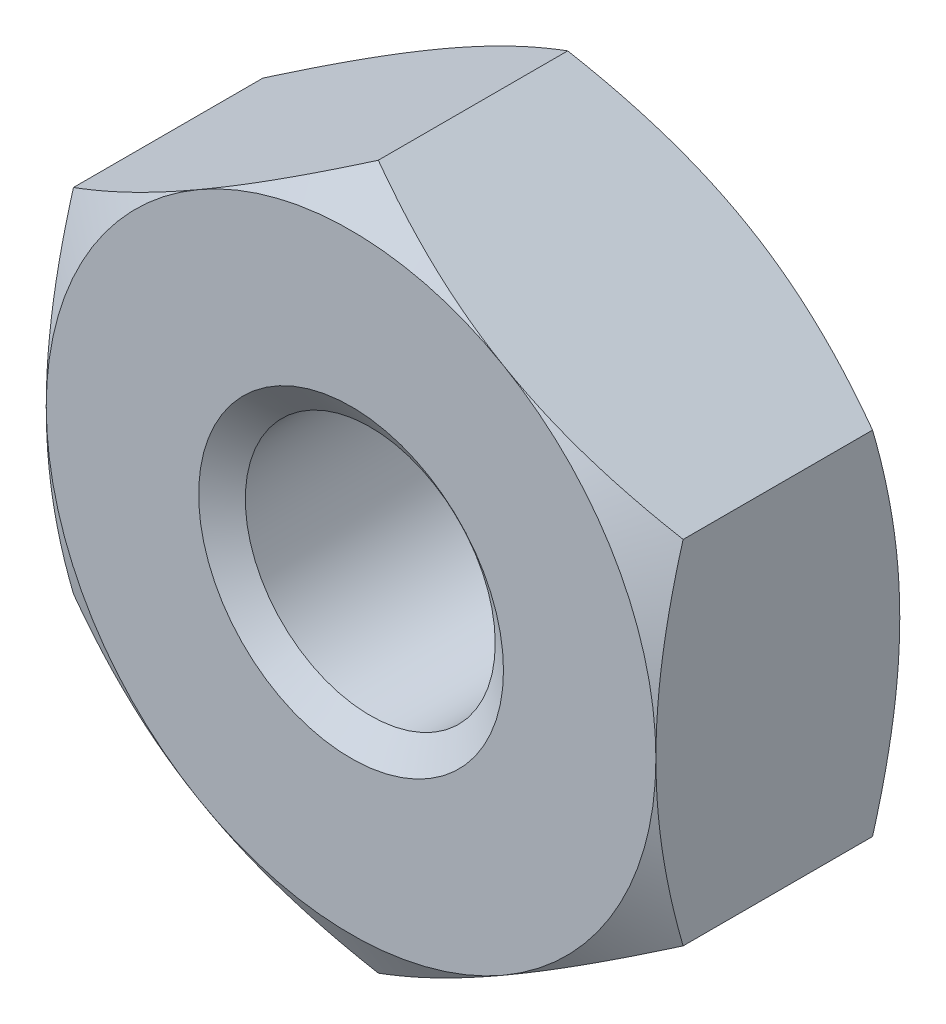
ISO-10303-21;
HEADER;
FILE_DESCRIPTION(('STEP AP214'),'2;1');
FILE_NAME('part.step','',(''),(''),'','','');
FILE_SCHEMA(('AUTOMOTIVE_DESIGN { 1 0 10303 214 1 1 1 1 }'));
ENDSEC;
DATA;
#1=APPLICATION_CONTEXT('core data for automotive mechanical design processes');
#2=APPLICATION_PROTOCOL_DEFINITION('international standard','automotive_design',2000,#1);
#3=PRODUCT_CONTEXT('',#1,'mechanical');
#4=PRODUCT('Part','Part','',(#3));
#5=PRODUCT_RELATED_PRODUCT_CATEGORY('part','',(#4));
#6=PRODUCT_DEFINITION_FORMATION('','',#4);
#7=PRODUCT_DEFINITION_CONTEXT('part definition',#1,'design');
#8=PRODUCT_DEFINITION('design','',#6,#7);
#9=PRODUCT_DEFINITION_SHAPE('','',#8);
#10=(LENGTH_UNIT() NAMED_UNIT(*) SI_UNIT(.MILLI.,.METRE.));
#11=(NAMED_UNIT(*) PLANE_ANGLE_UNIT() SI_UNIT($,.RADIAN.));
#12=(NAMED_UNIT(*) SI_UNIT($,.STERADIAN.) SOLID_ANGLE_UNIT());
#13=UNCERTAINTY_MEASURE_WITH_UNIT(LENGTH_MEASURE(1.E-05),#10,'distance_accuracy_value','');
#14=(GEOMETRIC_REPRESENTATION_CONTEXT(3) GLOBAL_UNCERTAINTY_ASSIGNED_CONTEXT((#13)) GLOBAL_UNIT_ASSIGNED_CONTEXT((#10,
#11,#12)) REPRESENTATION_CONTEXT('',''));
#15=CARTESIAN_POINT('',(0.,0.,0.));
#16=DIRECTION('',(0.,0.,1.));
#17=DIRECTION('',(1.,0.,0.));
#18=AXIS2_PLACEMENT_3D('',#15,#16,#17);
#19=CARTESIAN_POINT('',(0.,0.,-2.));
#20=DIRECTION('',(0.,0.,1.));
#21=DIRECTION('',(1.,0.,0.));
#22=AXIS2_PLACEMENT_3D('',#19,#20,#21);
#23=CYLINDRICAL_SURFACE('',#22,1.025);
#24=CARTESIAN_POINT('',(0.,0.,-0.157546696097184));
#25=DIRECTION('',(0.,0.,1.));
#26=DIRECTION('',(1.,0.,0.));
#27=AXIS2_PLACEMENT_3D('',#24,#25,#26);
#28=CIRCLE('',#27,1.025);
#29=CARTESIAN_POINT('',(1.025,0.,-0.157546696097184));
#30=VERTEX_POINT('',#29);
#31=EDGE_CURVE('E175',#30,#30,#28,.F.);
#32=ORIENTED_EDGE('',*,*,#31,.F.);
#33=EDGE_LOOP('',(#32));
#34=FACE_BOUND('',#33,.T.);
#35=CARTESIAN_POINT('',(0.,0.,-1.81705330390281));
#36=DIRECTION('',(0.,0.,-1.));
#37=DIRECTION('',(-1.,0.,0.));
#38=AXIS2_PLACEMENT_3D('',#35,#36,#37);
#39=CIRCLE('',#38,1.025);
#40=CARTESIAN_POINT('',(-1.025,0.,-1.81705330390281));
#41=VERTEX_POINT('',#40);
#42=EDGE_CURVE('E40',#41,#41,#39,.F.);
#43=ORIENTED_EDGE('',*,*,#42,.F.);
#44=EDGE_LOOP('',(#43));
#45=FACE_BOUND('',#44,.T.);
#46=ADVANCED_FACE('F35',(#34,#45),#23,.F.);
#47=CARTESIAN_POINT('',(0.,2.88675134594813,-2.));
#48=DIRECTION('',(-0.500000000000001,0.866025403784438,0.));
#49=DIRECTION('',(-0.866025403784438,-0.500000000000001,0.));
#50=AXIS2_PLACEMENT_3D('',#47,#48,#49);
#51=PLANE('',#50);
#52=DIRECTION('',(0.,0.,1.));
#53=VECTOR('',#52,1.);
#54=CARTESIAN_POINT('',(-2.5,1.44337567297406,-2.));
#55=LINE('',#54,#53);
#56=CARTESIAN_POINT('',(-2.5,1.44337567297407,-1.7767090063074));
#57=VERTEX_POINT('',#56);
#58=CARTESIAN_POINT('',(-2.5,1.44337567297406,-0.223290993692603));
#59=VERTEX_POINT('',#58);
#60=EDGE_CURVE('E165',#57,#59,#55,.T.);
#61=ORIENTED_EDGE('',*,*,#60,.T.);
#62=CARTESIAN_POINT('',(-2.5002,1.44326020292023,-0.22335766435911));
#63=CARTESIAN_POINT('',(-2.39033676526513,1.50668977106845,-0.186721620107627));
#64=CARTESIAN_POINT('',(-2.27952520010347,1.57066685804385,-0.153402218965057));
#65=CARTESIAN_POINT('',(-2.05598316653395,1.69972891130041,-0.0952422855578579));
#66=CARTESIAN_POINT('',(-1.94324872547161,1.7648161711947,-0.0704223291477383));
#67=CARTESIAN_POINT('',(-1.71917700612473,1.8941840386774,-0.0317856514410519));
#68=CARTESIAN_POINT('',(-1.60787420823262,1.95844473900197,-0.0177117961856387));
#69=CARTESIAN_POINT('',(-1.38474477253167,2.08726857876804,-0.000909152352749973));
#70=CARTESIAN_POINT('',(-1.27291894598577,2.15183124982667,0.00183354879637358));
#71=CARTESIAN_POINT('',(-1.06395802444848,2.27247489412634,-0.0038657600080535));
#72=CARTESIAN_POINT('',(-0.966791682442268,2.32857390783979,-0.0109083943818617));
#73=CARTESIAN_POINT('',(-0.773092050288997,2.44040644260542,-0.033231419124943));
#74=CARTESIAN_POINT('',(-0.676559430340267,2.4961395767184,-0.0485194384402678));
#75=CARTESIAN_POINT('',(-0.482460278259524,2.60820277442169,-0.0867390938444215));
#76=CARTESIAN_POINT('',(-0.384918318217859,2.66451865130903,-0.109832776125518));
#77=CARTESIAN_POINT('',(-0.191289391923915,2.77631036402774,-0.162246656577915));
#78=CARTESIAN_POINT('',(-0.0951999441138236,2.83178763258718,-0.19155453562455));
#79=CARTESIAN_POINT('',(0.000200000000000361,2.88686681600197,-0.223357664359111));
#80=B_SPLINE_CURVE_WITH_KNOTS('',3,(#62,#63,#64,#65,#66,#67,#68,#69,#70,#71,#72,#73,#74,#75,#76,
#77,#78,#79),.UNSPECIFIED.,.F.,.F.,(4,2,2,2,2,2,2,2,4),(0.,0.396285827362227,0.793524330152052,
1.18093086852114,1.56786160134476,1.90479741793733,2.24204551660463,2.58677531536756,
2.93082800105257),.UNSPECIFIED.);
#81=CARTESIAN_POINT('',(-1.25,2.1650635094611,0.));
#82=VERTEX_POINT('',#81);
#83=EDGE_CURVE('E134',#59,#82,#80,.T.);
#84=ORIENTED_EDGE('',*,*,#83,.T.);
#85=CARTESIAN_POINT('',(0.,2.88675134594813,-0.223290993692604));
#86=VERTEX_POINT('',#85);
#87=EDGE_CURVE('E54',#82,#86,#80,.T.);
#88=ORIENTED_EDGE('',*,*,#87,.T.);
#89=DIRECTION('',(0.,0.,1.));
#90=VECTOR('',#89,1.);
#91=CARTESIAN_POINT('',(0.,2.88675134594813,-2.));
#92=LINE('',#91,#90);
#93=CARTESIAN_POINT('',(0.,2.88675134594813,-1.7767090063074));
#94=VERTEX_POINT('',#93);
#95=EDGE_CURVE('E150',#94,#86,#92,.T.);
#96=ORIENTED_EDGE('',*,*,#95,.F.);
#97=CARTESIAN_POINT('',(-2.5002,1.44326020292023,-1.77664233564089));
#98=CARTESIAN_POINT('',(-2.39033676526513,1.50668977106845,-1.81327837989237));
#99=CARTESIAN_POINT('',(-2.27952520010347,1.57066685804385,-1.84659778103494));
#100=CARTESIAN_POINT('',(-2.05598316653395,1.69972891130041,-1.90475771444214));
#101=CARTESIAN_POINT('',(-1.94324872547161,1.7648161711947,-1.92957767085226));
#102=CARTESIAN_POINT('',(-1.71917700612473,1.8941840386774,-1.96821434855895));
#103=CARTESIAN_POINT('',(-1.60787420823262,1.95844473900197,-1.98228820381436));
#104=CARTESIAN_POINT('',(-1.38474477253167,2.08726857876804,-1.99909084764725));
#105=CARTESIAN_POINT('',(-1.27291894598577,2.15183124982667,-2.00183354879637));
#106=CARTESIAN_POINT('',(-1.06395802444848,2.27247489412634,-1.99613423999195));
#107=CARTESIAN_POINT('',(-0.966791682442269,2.32857390783979,-1.98909160561814));
#108=CARTESIAN_POINT('',(-0.773092050288997,2.44040644260542,-1.96676858087506));
#109=CARTESIAN_POINT('',(-0.676559430340268,2.4961395767184,-1.95148056155973));
#110=CARTESIAN_POINT('',(-0.482460278259524,2.60820277442169,-1.91326090615558));
#111=CARTESIAN_POINT('',(-0.384918318217859,2.66451865130903,-1.89016722387448));
#112=CARTESIAN_POINT('',(-0.191289391923915,2.77631036402774,-1.83775334342209));
#113=CARTESIAN_POINT('',(-0.0951999441138236,2.83178763258718,-1.80844546437545));
#114=CARTESIAN_POINT('',(0.00020000000000024,2.88686681600197,-1.77664233564089));
#115=B_SPLINE_CURVE_WITH_KNOTS('',3,(#97,#98,#99,#100,#101,#102,#103,#104,#105,#106,#107,#108,
#109,#110,#111,#112,#113,#114),.UNSPECIFIED.,.F.,.F.,(4,2,2,2,2,2,2,2,4),(0.,0.396285827362227,
0.793524330152052,1.18093086852114,1.56786160134475,1.90479741793733,2.24204551660463,
2.58677531536756,2.93082800105257),.UNSPECIFIED.);
#116=CARTESIAN_POINT('',(-1.25,2.1650635094611,-2.));
#117=VERTEX_POINT('',#116);
#118=EDGE_CURVE('E168',#117,#94,#115,.T.);
#119=ORIENTED_EDGE('',*,*,#118,.F.);
#120=EDGE_CURVE('E267',#57,#117,#115,.T.);
#121=ORIENTED_EDGE('',*,*,#120,.F.);
#122=EDGE_LOOP('',(#61,#84,#88,#96,#119,#121));
#123=FACE_BOUND('',#122,.T.);
#124=ADVANCED_FACE('F37',(#123),#51,.T.);
#125=CARTESIAN_POINT('',(2.5,1.44337567297406,-2.));
#126=DIRECTION('',(0.500000000000001,0.866025403784438,0.));
#127=DIRECTION('',(-0.866025403784438,0.500000000000001,0.));
#128=AXIS2_PLACEMENT_3D('',#125,#126,#127);
#129=PLANE('',#128);
#130=ORIENTED_EDGE('',*,*,#95,.T.);
#131=CARTESIAN_POINT('',(-0.000199999999999988,2.88686681600197,-0.223357664359111));
#132=CARTESIAN_POINT('',(0.109663234734871,2.82343724785375,-0.186721620107628));
#133=CARTESIAN_POINT('',(0.220474799896526,2.75946016087834,-0.153402218965058));
#134=CARTESIAN_POINT('',(0.44401683346605,2.63039810762178,-0.0952422855578587));
#135=CARTESIAN_POINT('',(0.556751274528389,2.5653108477275,-0.070422329147739));
#136=CARTESIAN_POINT('',(0.78082299387527,2.43594298024479,-0.0317856514410522));
#137=CARTESIAN_POINT('',(0.892125791767378,2.37168227992023,-0.0177117961856388));
#138=CARTESIAN_POINT('',(1.11525522746834,2.24285844015415,-0.000909152352749793));
#139=CARTESIAN_POINT('',(1.22708105401423,2.17829576909552,0.00183354879637375));
#140=CARTESIAN_POINT('',(1.43604197555152,2.05765212479586,-0.00386576000805319));
#141=CARTESIAN_POINT('',(1.53320831755773,2.0015531110824,-0.0109083943818613));
#142=CARTESIAN_POINT('',(1.726907949711,1.88972057631678,-0.0332314191249422));
#143=CARTESIAN_POINT('',(1.82344056965973,1.8339874422038,-0.0485194384402669));
#144=CARTESIAN_POINT('',(2.01753972174048,1.7219242445005,-0.0867390938444204));
#145=CARTESIAN_POINT('',(2.11508168178214,1.66560836761316,-0.109832776125517));
#146=CARTESIAN_POINT('',(2.30871060807609,1.55381665489445,-0.162246656577914));
#147=CARTESIAN_POINT('',(2.40480005588618,1.49833938633502,-0.191554535624549));
#148=CARTESIAN_POINT('',(2.5002,1.44326020292022,-0.223357664359109));
#149=B_SPLINE_CURVE_WITH_KNOTS('',3,(#131,#132,#133,#134,#135,#136,#137,#138,#139,#140,#141,
#142,#143,#144,#145,#146,#147,#148),.UNSPECIFIED.,.F.,.F.,(4,2,2,2,2,2,2,2,4),(0.,
0.396285827362228,0.793524330152053,1.18093086852114,1.56786160134476,1.90479741793733,
2.24204551660463,2.58677531536756,2.93082800105257),.UNSPECIFIED.);
#150=CARTESIAN_POINT('',(1.25,2.1650635094611,0.));
#151=VERTEX_POINT('',#150);
#152=EDGE_CURVE('E144',#86,#151,#149,.T.);
#153=ORIENTED_EDGE('',*,*,#152,.T.);
#154=CARTESIAN_POINT('',(2.5,1.44337567297407,-0.223290993692604));
#155=VERTEX_POINT('',#154);
#156=EDGE_CURVE('E61',#151,#155,#149,.T.);
#157=ORIENTED_EDGE('',*,*,#156,.T.);
#158=DIRECTION('',(0.,0.,1.));
#159=VECTOR('',#158,1.);
#160=CARTESIAN_POINT('',(2.5,1.44337567297406,-2.));
#161=LINE('',#160,#159);
#162=CARTESIAN_POINT('',(2.5,1.44337567297407,-1.7767090063074));
#163=VERTEX_POINT('',#162);
#164=EDGE_CURVE('E143',#163,#155,#161,.T.);
#165=ORIENTED_EDGE('',*,*,#164,.F.);
#166=CARTESIAN_POINT('',(-0.000199999999999988,2.88686681600197,-1.77664233564089));
#167=CARTESIAN_POINT('',(0.109663234734871,2.82343724785375,-1.81327837989237));
#168=CARTESIAN_POINT('',(0.220474799896526,2.75946016087834,-1.84659778103494));
#169=CARTESIAN_POINT('',(0.44401683346605,2.63039810762178,-1.90475771444214));
#170=CARTESIAN_POINT('',(0.556751274528389,2.5653108477275,-1.92957767085226));
#171=CARTESIAN_POINT('',(0.78082299387527,2.43594298024479,-1.96821434855895));
#172=CARTESIAN_POINT('',(0.892125791767378,2.37168227992023,-1.98228820381436));
#173=CARTESIAN_POINT('',(1.11525522746833,2.24285844015415,-1.99909084764725));
#174=CARTESIAN_POINT('',(1.22708105401423,2.17829576909552,-2.00183354879637));
#175=CARTESIAN_POINT('',(1.43604197555152,2.05765212479586,-1.99613423999195));
#176=CARTESIAN_POINT('',(1.53320831755773,2.0015531110824,-1.98909160561814));
#177=CARTESIAN_POINT('',(1.726907949711,1.88972057631678,-1.96676858087506));
#178=CARTESIAN_POINT('',(1.82344056965973,1.8339874422038,-1.95148056155973));
#179=CARTESIAN_POINT('',(2.01753972174048,1.7219242445005,-1.91326090615558));
#180=CARTESIAN_POINT('',(2.11508168178214,1.66560836761316,-1.89016722387448));
#181=CARTESIAN_POINT('',(2.30871060807609,1.55381665489446,-1.83775334342209));
#182=CARTESIAN_POINT('',(2.40480005588618,1.49833938633502,-1.80844546437545));
#183=CARTESIAN_POINT('',(2.5002,1.44326020292022,-1.77664233564089));
#184=B_SPLINE_CURVE_WITH_KNOTS('',3,(#166,#167,#168,#169,#170,#171,#172,#173,#174,#175,#176,
#177,#178,#179,#180,#181,#182,#183),.UNSPECIFIED.,.F.,.F.,(4,2,2,2,2,2,2,2,4),(0.,
0.396285827362228,0.793524330152053,1.18093086852114,1.56786160134476,1.90479741793733,
2.24204551660463,2.58677531536756,2.93082800105257),.UNSPECIFIED.);
#185=CARTESIAN_POINT('',(1.25,2.1650635094611,-2.));
#186=VERTEX_POINT('',#185);
#187=EDGE_CURVE('E260',#186,#163,#184,.T.);
#188=ORIENTED_EDGE('',*,*,#187,.F.);
#189=EDGE_CURVE('E266',#94,#186,#184,.T.);
#190=ORIENTED_EDGE('',*,*,#189,.F.);
#191=EDGE_LOOP('',(#130,#153,#157,#165,#188,#190));
#192=FACE_BOUND('',#191,.T.);
#193=ADVANCED_FACE('F141',(#192),#129,.T.);
#194=CARTESIAN_POINT('',(2.5,1.44337567297406,-2.));
#195=DIRECTION('',(-1.,0.,0.));
#196=DIRECTION('',(0.,0.,1.));
#197=AXIS2_PLACEMENT_3D('',#194,#195,#196);
#198=PLANE('',#197);
#199=CARTESIAN_POINT('',(2.5,-3.82804499372433,-1.1963167632754));
#200=CARTESIAN_POINT('',(2.5,-3.71828085649173,-1.14327266922931));
#201=CARTESIAN_POINT('',(2.5,-3.60825720059554,-1.09075587737963));
#202=CARTESIAN_POINT('',(2.5,-3.38755052986222,-0.98707821674823));
#203=CARTESIAN_POINT('',(2.5,-3.27686740487455,-0.935917582729522));
#204=CARTESIAN_POINT('',(2.5,-3.05410357303959,-0.8349840394116));
#205=CARTESIAN_POINT('',(2.5,-2.94201849305851,-0.785220746914401));
#206=CARTESIAN_POINT('',(2.5,-2.71692709217039,-0.687831615887687));
#207=CARTESIAN_POINT('',(2.5,-2.60392081964711,-0.640205665942514));
#208=CARTESIAN_POINT('',(2.5,-2.37540441715611,-0.547094156496478));
#209=CARTESIAN_POINT('',(2.5,-2.25988058014231,-0.501642052634905));
#210=CARTESIAN_POINT('',(2.5,-2.02747029246855,-0.414297644349638));
#211=CARTESIAN_POINT('',(2.5,-1.91058369184876,-0.372405735979066));
#212=CARTESIAN_POINT('',(2.5,-1.67550198908607,-0.293307342769302));
#213=CARTESIAN_POINT('',(2.5,-1.5573102732053,-0.256090896739899));
#214=CARTESIAN_POINT('',(2.5,-1.31924659147407,-0.187552097840317));
#215=CARTESIAN_POINT('',(2.5,-1.19937516991093,-0.15622788104797));
#216=CARTESIAN_POINT('',(2.5,-0.95787020436375,-0.100994246846276));
#217=CARTESIAN_POINT('',(2.5,-0.83623620019781,-0.0770868037228377));
#218=CARTESIAN_POINT('',(2.5,-0.591501703670346,-0.0382963974514645));
#219=CARTESIAN_POINT('',(2.5,-0.468401210012359,-0.0234134422823116));
#220=CARTESIAN_POINT('',(2.5,-0.222157493517464,-0.00398863321839732));
#221=CARTESIAN_POINT('',(2.5,-0.099019569433757,0.000618687975651157));
#222=CARTESIAN_POINT('',(2.5,0.147170053504668,-0.000752541484247112));
#223=CARTESIAN_POINT('',(2.5,0.270221766445128,-0.00672834425959419));
#224=CARTESIAN_POINT('',(2.5,0.480350397015948,-0.0255492091334943));
#225=CARTESIAN_POINT('',(2.5,0.567659136488637,-0.0359433100274437));
#226=CARTESIAN_POINT('',(2.5,0.741602181646858,-0.0613833814666825));
#227=CARTESIAN_POINT('',(2.5,0.828236378756332,-0.0764300856615292));
#228=CARTESIAN_POINT('',(2.5,1.08705653408106,-0.127759419343895));
#229=CARTESIAN_POINT('',(2.5,1.25802931580451,-0.170218054015721));
#230=CARTESIAN_POINT('',(2.5,1.51386408134077,-0.243447724573253));
#231=CARTESIAN_POINT('',(2.5,1.60005960225961,-0.269821213632273));
#232=CARTESIAN_POINT('',(2.5,1.77155099438377,-0.325177862642352));
#233=CARTESIAN_POINT('',(2.5,1.85684744139723,-0.354159222616821));
#234=CARTESIAN_POINT('',(2.5,2.02618400322713,-0.41412856198768));
#235=CARTESIAN_POINT('',(2.5,2.11022848716774,-0.445104328595938));
#236=CARTESIAN_POINT('',(2.5,2.27766538220571,-0.508873971119189));
#237=CARTESIAN_POINT('',(2.5,2.36105751399617,-0.541668581852106));
#238=CARTESIAN_POINT('',(2.5,2.44414811866677,-0.575193129088621));
#239=B_SPLINE_CURVE_WITH_KNOTS('',3,(#199,#200,#201,#202,#203,#204,#205,#206,#207,#208,#209,
#210,#211,#212,#213,#214,#215,#216,#217,#218,#219,#220,#221,#222,#223,#224,#225,#226,#227,#228,
#229,#230,#231,#232,#233,#234,#235,#236,#237,#238),.UNSPECIFIED.,.F.,.F.,(4,2,2,2,2,2,2,2,2,2,2,
2,2,2,2,2,2,2,2,4),(0.,0.36573237033267,0.731527644124543,1.09941621653744,1.46728558928017,
1.83967125623427,2.21209829506681,2.58371790436,2.95521975869669,3.32682041917403,
3.69842140819258,4.06764803658773,4.43677881037429,4.70042588015951,4.96411454456775,
5.49188432099894,5.76228301186056,6.03249648197686,6.30118900914356,6.56999089095293),.UNSPECIFIED.);
#240=CARTESIAN_POINT('',(2.5,-1.44337567297407,-0.223290993692604));
#241=VERTEX_POINT('',#240);
#242=CARTESIAN_POINT('',(2.5,0.,0.));
#243=VERTEX_POINT('',#242);
#244=EDGE_CURVE('E136',#241,#243,#239,.T.);
#245=ORIENTED_EDGE('',*,*,#244,.F.);
#246=DIRECTION('',(0.,0.,1.));
#247=VECTOR('',#246,1.);
#248=CARTESIAN_POINT('',(2.5,-1.44337567297407,-2.));
#249=LINE('',#248,#247);
#250=CARTESIAN_POINT('',(2.5,-1.44337567297407,-1.7767090063074));
#251=VERTEX_POINT('',#250);
#252=EDGE_CURVE('E151',#251,#241,#249,.T.);
#253=ORIENTED_EDGE('',*,*,#252,.F.);
#254=CARTESIAN_POINT('',(2.5,-3.82804499372433,-0.803683236724597));
#255=CARTESIAN_POINT('',(2.5,-3.71828085649173,-0.856727330770685));
#256=CARTESIAN_POINT('',(2.5,-3.60825720059554,-0.909244122620373));
#257=CARTESIAN_POINT('',(2.5,-3.38755052986222,-1.01292178325177));
#258=CARTESIAN_POINT('',(2.5,-3.27686740487455,-1.06408241727048));
#259=CARTESIAN_POINT('',(2.5,-3.05410357303959,-1.1650159605884));
#260=CARTESIAN_POINT('',(2.5,-2.94201849305851,-1.2147792530856));
#261=CARTESIAN_POINT('',(2.5,-2.71692709217039,-1.31216838411231));
#262=CARTESIAN_POINT('',(2.5,-2.60392081964711,-1.35979433405749));
#263=CARTESIAN_POINT('',(2.5,-2.37540441715611,-1.45290584350352));
#264=CARTESIAN_POINT('',(2.5,-2.25988058014231,-1.4983579473651));
#265=CARTESIAN_POINT('',(2.5,-2.02747029246855,-1.58570235565036));
#266=CARTESIAN_POINT('',(2.5,-1.91058369184876,-1.62759426402093));
#267=CARTESIAN_POINT('',(2.5,-1.67550198908607,-1.7066926572307));
#268=CARTESIAN_POINT('',(2.5,-1.5573102732053,-1.7439091032601));
#269=CARTESIAN_POINT('',(2.5,-1.31924659147407,-1.81244790215968));
#270=CARTESIAN_POINT('',(2.5,-1.19937516991093,-1.84377211895203));
#271=CARTESIAN_POINT('',(2.5,-0.95787020436375,-1.89900575315372));
#272=CARTESIAN_POINT('',(2.5,-0.83623620019781,-1.92291319627716));
#273=CARTESIAN_POINT('',(2.5,-0.591501703670346,-1.96170360254854));
#274=CARTESIAN_POINT('',(2.5,-0.468401210012358,-1.97658655771769));
#275=CARTESIAN_POINT('',(2.5,-0.222157493517464,-1.9960113667816));
#276=CARTESIAN_POINT('',(2.5,-0.0990195694337566,-2.00061868797565));
#277=CARTESIAN_POINT('',(2.5,0.147170053504668,-1.99924745851575));
#278=CARTESIAN_POINT('',(2.5,0.270221766445129,-1.99327165574041));
#279=CARTESIAN_POINT('',(2.5,0.480350397015948,-1.97445079086651));
#280=CARTESIAN_POINT('',(2.5,0.567659136488637,-1.96405668997256));
#281=CARTESIAN_POINT('',(2.5,0.741602181646857,-1.93861661853332));
#282=CARTESIAN_POINT('',(2.5,0.828236378756332,-1.92356991433847));
#283=CARTESIAN_POINT('',(2.5,1.08705653408106,-1.87224058065611));
#284=CARTESIAN_POINT('',(2.5,1.25802931580451,-1.82978194598428));
#285=CARTESIAN_POINT('',(2.5,1.51386408134077,-1.75655227542675));
#286=CARTESIAN_POINT('',(2.5,1.60005960225961,-1.73017878636773));
#287=CARTESIAN_POINT('',(2.5,1.77155099438377,-1.67482213735765));
#288=CARTESIAN_POINT('',(2.5,1.85684744139723,-1.64584077738318));
#289=CARTESIAN_POINT('',(2.5,2.02618400322713,-1.58587143801232));
#290=CARTESIAN_POINT('',(2.5,2.11022848716773,-1.55489567140406));
#291=CARTESIAN_POINT('',(2.5,2.27766538220571,-1.49112602888081));
#292=CARTESIAN_POINT('',(2.5,2.36105751399617,-1.45833141814789));
#293=CARTESIAN_POINT('',(2.5,2.44414811866677,-1.42480687091138));
#294=B_SPLINE_CURVE_WITH_KNOTS('',3,(#254,#255,#256,#257,#258,#259,#260,#261,#262,#263,#264,
#265,#266,#267,#268,#269,#270,#271,#272,#273,#274,#275,#276,#277,#278,#279,#280,#281,#282,#283,
#284,#285,#286,#287,#288,#289,#290,#291,#292,#293),.UNSPECIFIED.,.F.,.F.,(4,2,2,2,2,2,2,2,2,2,2,
2,2,2,2,2,2,2,2,4),(0.,0.36573237033267,0.731527644124543,1.09941621653744,1.46728558928017,
1.83967125623427,2.21209829506681,2.58371790436,2.95521975869669,3.32682041917403,
3.69842140819258,4.06764803658773,4.43677881037429,4.70042588015951,4.96411454456775,
5.49188432099893,5.76228301186056,6.03249648197686,6.30118900914356,6.56999089095293),.UNSPECIFIED.);
#295=CARTESIAN_POINT('',(2.5,0.,-2.));
#296=VERTEX_POINT('',#295);
#297=EDGE_CURVE('E274',#251,#296,#294,.T.);
#298=ORIENTED_EDGE('',*,*,#297,.T.);
#299=EDGE_CURVE('E149',#296,#163,#294,.T.);
#300=ORIENTED_EDGE('',*,*,#299,.T.);
#301=ORIENTED_EDGE('',*,*,#164,.T.);
#302=EDGE_CURVE('E126',#243,#155,#239,.T.);
#303=ORIENTED_EDGE('',*,*,#302,.F.);
#304=EDGE_LOOP('',(#245,#253,#298,#300,#301,#303));
#305=FACE_BOUND('',#304,.T.);
#306=ADVANCED_FACE('F147',(#305),#198,.F.);
#307=CARTESIAN_POINT('',(0.,-2.88675134594813,-2.));
#308=DIRECTION('',(0.500000000000001,-0.866025403784438,0.));
#309=DIRECTION('',(0.866025403784438,0.500000000000001,0.));
#310=AXIS2_PLACEMENT_3D('',#307,#308,#309);
#311=PLANE('',#310);
#312=ORIENTED_EDGE('',*,*,#252,.T.);
#313=CARTESIAN_POINT('',(2.5002,-1.44326020292023,-0.223357664359111));
#314=CARTESIAN_POINT('',(2.39033676526513,-1.50668977106845,-0.186721620107628));
#315=CARTESIAN_POINT('',(2.27952520010347,-1.57066685804386,-0.153402218965058));
#316=CARTESIAN_POINT('',(2.05598316653395,-1.69972891130042,-0.0952422855578591));
#317=CARTESIAN_POINT('',(1.94324872547161,-1.7648161711947,-0.0704223291477395));
#318=CARTESIAN_POINT('',(1.71917700612473,-1.8941840386774,-0.0317856514410532));
#319=CARTESIAN_POINT('',(1.60787420823262,-1.95844473900197,-0.0177117961856401));
#320=CARTESIAN_POINT('',(1.38474477253166,-2.08726857876805,-0.000909152352751682));
#321=CARTESIAN_POINT('',(1.27291894598577,-2.15183124982667,0.00183354879637176));
#322=CARTESIAN_POINT('',(1.06395802444848,-2.27247489412634,-0.00386576000805555));
#323=CARTESIAN_POINT('',(0.966791682442267,-2.3285739078398,-0.0109083943818639));
#324=CARTESIAN_POINT('',(0.773092050288996,-2.44040644260542,-0.0332314191249451));
#325=CARTESIAN_POINT('',(0.676559430340267,-2.4961395767184,-0.0485194384402699));
#326=CARTESIAN_POINT('',(0.482460278259523,-2.6082027744217,-0.0867390938444235));
#327=CARTESIAN_POINT('',(0.384918318217859,-2.66451865130904,-0.10983277612552));
#328=CARTESIAN_POINT('',(0.191289391923914,-2.77631036402774,-0.162246656577917));
#329=CARTESIAN_POINT('',(0.0951999441138235,-2.83178763258718,-0.191554535624552));
#330=CARTESIAN_POINT('',(-0.000200000000000339,-2.88686681600197,-0.223357664359113));
#331=B_SPLINE_CURVE_WITH_KNOTS('',3,(#313,#314,#315,#316,#317,#318,#319,#320,#321,#322,#323,
#324,#325,#326,#327,#328,#329,#330),.UNSPECIFIED.,.F.,.F.,(4,2,2,2,2,2,2,2,4),(0.,
0.396285827362228,0.793524330152053,1.18093086852114,1.56786160134476,1.90479741793733,
2.24204551660463,2.58677531536756,2.93082800105257),.UNSPECIFIED.);
#332=CARTESIAN_POINT('',(1.25,-2.1650635094611,0.));
#333=VERTEX_POINT('',#332);
#334=EDGE_CURVE('E372',#241,#333,#331,.T.);
#335=ORIENTED_EDGE('',*,*,#334,.T.);
#336=CARTESIAN_POINT('',(0.,-2.88675134594813,-0.223290993692604));
#337=VERTEX_POINT('',#336);
#338=EDGE_CURVE('E228',#333,#337,#331,.T.);
#339=ORIENTED_EDGE('',*,*,#338,.T.);
#340=DIRECTION('',(0.,0.,1.));
#341=VECTOR('',#340,1.);
#342=CARTESIAN_POINT('',(0.,-2.88675134594813,-2.));
#343=LINE('',#342,#341);
#344=CARTESIAN_POINT('',(0.,-2.88675134594813,-1.7767090063074));
#345=VERTEX_POINT('',#344);
#346=EDGE_CURVE('E156',#345,#337,#343,.T.);
#347=ORIENTED_EDGE('',*,*,#346,.F.);
#348=CARTESIAN_POINT('',(2.5002,-1.44326020292023,-1.77664233564089));
#349=CARTESIAN_POINT('',(2.39033676526513,-1.50668977106845,-1.81327837989237));
#350=CARTESIAN_POINT('',(2.27952520010347,-1.57066685804386,-1.84659778103494));
#351=CARTESIAN_POINT('',(2.05598316653395,-1.69972891130042,-1.90475771444214));
#352=CARTESIAN_POINT('',(1.94324872547161,-1.7648161711947,-1.92957767085226));
#353=CARTESIAN_POINT('',(1.71917700612473,-1.8941840386774,-1.96821434855895));
#354=CARTESIAN_POINT('',(1.60787420823262,-1.95844473900197,-1.98228820381436));
#355=CARTESIAN_POINT('',(1.38474477253166,-2.08726857876805,-1.99909084764725));
#356=CARTESIAN_POINT('',(1.27291894598577,-2.15183124982667,-2.00183354879637));
#357=CARTESIAN_POINT('',(1.06395802444848,-2.27247489412634,-1.99613423999194));
#358=CARTESIAN_POINT('',(0.966791682442267,-2.3285739078398,-1.98909160561814));
#359=CARTESIAN_POINT('',(0.773092050288996,-2.44040644260542,-1.96676858087506));
#360=CARTESIAN_POINT('',(0.676559430340266,-2.4961395767184,-1.95148056155973));
#361=CARTESIAN_POINT('',(0.482460278259523,-2.6082027744217,-1.91326090615558));
#362=CARTESIAN_POINT('',(0.384918318217859,-2.66451865130904,-1.89016722387448));
#363=CARTESIAN_POINT('',(0.191289391923914,-2.77631036402774,-1.83775334342208));
#364=CARTESIAN_POINT('',(0.0951999441138236,-2.83178763258718,-1.80844546437545));
#365=CARTESIAN_POINT('',(-0.000200000000000335,-2.88686681600197,-1.77664233564089));
#366=B_SPLINE_CURVE_WITH_KNOTS('',3,(#348,#349,#350,#351,#352,#353,#354,#355,#356,#357,#358,
#359,#360,#361,#362,#363,#364,#365),.UNSPECIFIED.,.F.,.F.,(4,2,2,2,2,2,2,2,4),(0.,
0.396285827362228,0.793524330152053,1.18093086852114,1.56786160134476,1.90479741793733,
2.24204551660463,2.58677531536756,2.93082800105257),.UNSPECIFIED.);
#367=CARTESIAN_POINT('',(1.25,-2.1650635094611,-2.));
#368=VERTEX_POINT('',#367);
#369=EDGE_CURVE('E281',#368,#345,#366,.T.);
#370=ORIENTED_EDGE('',*,*,#369,.F.);
#371=EDGE_CURVE('E280',#251,#368,#366,.T.);
#372=ORIENTED_EDGE('',*,*,#371,.F.);
#373=EDGE_LOOP('',(#312,#335,#339,#347,#370,#372));
#374=FACE_BOUND('',#373,.T.);
#375=ADVANCED_FACE('F293',(#374),#311,.T.);
#376=CARTESIAN_POINT('',(-2.5,-1.44337567297407,-2.));
#377=DIRECTION('',(-0.500000000000001,-0.866025403784438,0.));
#378=DIRECTION('',(0.866025403784438,-0.500000000000001,0.));
#379=AXIS2_PLACEMENT_3D('',#376,#377,#378);
#380=PLANE('',#379);
#381=ORIENTED_EDGE('',*,*,#346,.T.);
#382=CARTESIAN_POINT('',(0.000200000000000044,-2.88686681600197,-0.223357664359112));
#383=CARTESIAN_POINT('',(-0.109663234734871,-2.82343724785375,-0.18672162010763));
#384=CARTESIAN_POINT('',(-0.220474799896526,-2.75946016087835,-0.15340221896506));
#385=CARTESIAN_POINT('',(-0.44401683346605,-2.63039810762178,-0.0952422855578607));
#386=CARTESIAN_POINT('',(-0.556751274528389,-2.5653108477275,-0.0704223291477409));
#387=CARTESIAN_POINT('',(-0.78082299387527,-2.4359429802448,-0.0317856514410542));
#388=CARTESIAN_POINT('',(-0.892125791767379,-2.37168227992023,-0.0177117961856409));
#389=CARTESIAN_POINT('',(-1.11525522746834,-2.24285844015415,-0.000909152352751909));
#390=CARTESIAN_POINT('',(-1.22708105401423,-2.17829576909553,0.00183354879637182));
#391=CARTESIAN_POINT('',(-1.43604197555152,-2.05765212479586,-0.003865760008055));
#392=CARTESIAN_POINT('',(-1.53320831755773,-2.0015531110824,-0.0109083943818631));
#393=CARTESIAN_POINT('',(-1.726907949711,-1.88972057631678,-0.033231419124944));
#394=CARTESIAN_POINT('',(-1.82344056965973,-1.8339874422038,-0.0485194384402687));
#395=CARTESIAN_POINT('',(-2.01753972174048,-1.7219242445005,-0.086739093844422));
#396=CARTESIAN_POINT('',(-2.11508168178214,-1.66560836761317,-0.109832776125519));
#397=CARTESIAN_POINT('',(-2.30871060807609,-1.55381665489446,-0.162246656577915));
#398=CARTESIAN_POINT('',(-2.40480005588618,-1.49833938633502,-0.19155453562455));
#399=CARTESIAN_POINT('',(-2.5002,-1.44326020292023,-0.22335766435911));
#400=B_SPLINE_CURVE_WITH_KNOTS('',3,(#382,#383,#384,#385,#386,#387,#388,#389,#390,#391,#392,
#393,#394,#395,#396,#397,#398,#399),.UNSPECIFIED.,.F.,.F.,(4,2,2,2,2,2,2,2,4),(0.,
0.396285827362228,0.793524330152053,1.18093086852114,1.56786160134476,1.90479741793733,
2.24204551660463,2.58677531536756,2.93082800105257),.UNSPECIFIED.);
#401=CARTESIAN_POINT('',(-1.25,-2.1650635094611,0.));
#402=VERTEX_POINT('',#401);
#403=EDGE_CURVE('E369',#337,#402,#400,.T.);
#404=ORIENTED_EDGE('',*,*,#403,.T.);
#405=CARTESIAN_POINT('',(-2.5,-1.44337567297407,-0.223290993692604));
#406=VERTEX_POINT('',#405);
#407=EDGE_CURVE('E201',#402,#406,#400,.T.);
#408=ORIENTED_EDGE('',*,*,#407,.T.);
#409=DIRECTION('',(0.,0.,1.));
#410=VECTOR('',#409,1.);
#411=CARTESIAN_POINT('',(-2.5,-1.44337567297407,-2.));
#412=LINE('',#411,#410);
#413=CARTESIAN_POINT('',(-2.5,-1.44337567297407,-1.7767090063074));
#414=VERTEX_POINT('',#413);
#415=EDGE_CURVE('E162',#414,#406,#412,.T.);
#416=ORIENTED_EDGE('',*,*,#415,.F.);
#417=CARTESIAN_POINT('',(0.000200000000000023,-2.88686681600197,-1.77664233564089));
#418=CARTESIAN_POINT('',(-0.109663234734871,-2.82343724785375,-1.81327837989237));
#419=CARTESIAN_POINT('',(-0.220474799896526,-2.75946016087835,-1.84659778103494));
#420=CARTESIAN_POINT('',(-0.44401683346605,-2.63039810762178,-1.90475771444214));
#421=CARTESIAN_POINT('',(-0.556751274528389,-2.5653108477275,-1.92957767085226));
#422=CARTESIAN_POINT('',(-0.78082299387527,-2.4359429802448,-1.96821434855895));
#423=CARTESIAN_POINT('',(-0.892125791767379,-2.37168227992023,-1.98228820381436));
#424=CARTESIAN_POINT('',(-1.11525522746834,-2.24285844015415,-1.99909084764725));
#425=CARTESIAN_POINT('',(-1.22708105401423,-2.17829576909553,-2.00183354879637));
#426=CARTESIAN_POINT('',(-1.43604197555152,-2.05765212479586,-1.99613423999195));
#427=CARTESIAN_POINT('',(-1.53320831755773,-2.0015531110824,-1.98909160561814));
#428=CARTESIAN_POINT('',(-1.726907949711,-1.88972057631678,-1.96676858087506));
#429=CARTESIAN_POINT('',(-1.82344056965973,-1.8339874422038,-1.95148056155973));
#430=CARTESIAN_POINT('',(-2.01753972174048,-1.7219242445005,-1.91326090615558));
#431=CARTESIAN_POINT('',(-2.11508168178214,-1.66560836761317,-1.89016722387448));
#432=CARTESIAN_POINT('',(-2.30871060807609,-1.55381665489446,-1.83775334342209));
#433=CARTESIAN_POINT('',(-2.40480005588618,-1.49833938633502,-1.80844546437545));
#434=CARTESIAN_POINT('',(-2.5002,-1.44326020292023,-1.77664233564089));
#435=B_SPLINE_CURVE_WITH_KNOTS('',3,(#417,#418,#419,#420,#421,#422,#423,#424,#425,#426,#427,
#428,#429,#430,#431,#432,#433,#434),.UNSPECIFIED.,.F.,.F.,(4,2,2,2,2,2,2,2,4),(0.,
0.396285827362228,0.793524330152053,1.18093086852114,1.56786160134476,1.90479741793733,
2.24204551660463,2.58677531536756,2.93082800105257),.UNSPECIFIED.);
#436=CARTESIAN_POINT('',(-1.25,-2.1650635094611,-2.));
#437=VERTEX_POINT('',#436);
#438=EDGE_CURVE('E288',#437,#414,#435,.T.);
#439=ORIENTED_EDGE('',*,*,#438,.F.);
#440=EDGE_CURVE('E287',#345,#437,#435,.T.);
#441=ORIENTED_EDGE('',*,*,#440,.F.);
#442=EDGE_LOOP('',(#381,#404,#408,#416,#439,#441));
#443=FACE_BOUND('',#442,.T.);
#444=ADVANCED_FACE('F296',(#443),#380,.T.);
#445=CARTESIAN_POINT('',(-2.5,1.44337567297406,-2.));
#446=DIRECTION('',(-1.,0.,0.));
#447=DIRECTION('',(0.,0.,1.));
#448=AXIS2_PLACEMENT_3D('',#445,#446,#447);
#449=PLANE('',#448);
#450=ORIENTED_EDGE('',*,*,#415,.T.);
#451=CARTESIAN_POINT('',(-2.5,-3.82804499372433,-1.1963167632754));
#452=CARTESIAN_POINT('',(-2.5,-3.71828085649173,-1.14327266922931));
#453=CARTESIAN_POINT('',(-2.5,-3.60825720059554,-1.09075587737963));
#454=CARTESIAN_POINT('',(-2.5,-3.38755052986222,-0.98707821674823));
#455=CARTESIAN_POINT('',(-2.5,-3.27686740487455,-0.935917582729522));
#456=CARTESIAN_POINT('',(-2.5,-3.05410357303959,-0.8349840394116));
#457=CARTESIAN_POINT('',(-2.5,-2.94201849305851,-0.785220746914401));
#458=CARTESIAN_POINT('',(-2.5,-2.71692709217039,-0.687831615887687));
#459=CARTESIAN_POINT('',(-2.5,-2.60392081964711,-0.640205665942514));
#460=CARTESIAN_POINT('',(-2.5,-2.37540441715611,-0.547094156496478));
#461=CARTESIAN_POINT('',(-2.5,-2.25988058014231,-0.501642052634905));
#462=CARTESIAN_POINT('',(-2.5,-2.02747029246855,-0.414297644349638));
#463=CARTESIAN_POINT('',(-2.5,-1.91058369184876,-0.372405735979066));
#464=CARTESIAN_POINT('',(-2.5,-1.67550198908607,-0.293307342769302));
#465=CARTESIAN_POINT('',(-2.5,-1.5573102732053,-0.256090896739899));
#466=CARTESIAN_POINT('',(-2.5,-1.31924659147407,-0.187552097840317));
#467=CARTESIAN_POINT('',(-2.5,-1.19937516991093,-0.15622788104797));
#468=CARTESIAN_POINT('',(-2.5,-0.95787020436375,-0.100994246846276));
#469=CARTESIAN_POINT('',(-2.5,-0.83623620019781,-0.0770868037228377));
#470=CARTESIAN_POINT('',(-2.5,-0.591501703670346,-0.0382963974514646));
#471=CARTESIAN_POINT('',(-2.5,-0.468401210012359,-0.0234134422823116));
#472=CARTESIAN_POINT('',(-2.5,-0.222157493517464,-0.00398863321839731));
#473=CARTESIAN_POINT('',(-2.5,-0.0990195694337569,0.000618687975651136));
#474=CARTESIAN_POINT('',(-2.5,0.147170053504668,-0.000752541484247091));
#475=CARTESIAN_POINT('',(-2.5,0.270221766445129,-0.00672834425959409));
#476=CARTESIAN_POINT('',(-2.5,0.480350397015948,-0.0255492091334943));
#477=CARTESIAN_POINT('',(-2.5,0.567659136488637,-0.0359433100274439));
#478=CARTESIAN_POINT('',(-2.5,0.741602181646858,-0.0613833814666828));
#479=CARTESIAN_POINT('',(-2.5,0.828236378756332,-0.0764300856615293));
#480=CARTESIAN_POINT('',(-2.5,1.08705653408106,-0.127759419343895));
#481=CARTESIAN_POINT('',(-2.5,1.25802931580451,-0.170218054015721));
#482=CARTESIAN_POINT('',(-2.5,1.51386408134077,-0.243447724573253));
#483=CARTESIAN_POINT('',(-2.5,1.60005960225961,-0.269821213632273));
#484=CARTESIAN_POINT('',(-2.5,1.77155099438377,-0.325177862642352));
#485=CARTESIAN_POINT('',(-2.5,1.85684744139723,-0.354159222616821));
#486=CARTESIAN_POINT('',(-2.5,2.02618400322713,-0.414128561987679));
#487=CARTESIAN_POINT('',(-2.5,2.11022848716774,-0.445104328595938));
#488=CARTESIAN_POINT('',(-2.5,2.27766538220571,-0.508873971119189));
#489=CARTESIAN_POINT('',(-2.5,2.36105751399617,-0.541668581852106));
#490=CARTESIAN_POINT('',(-2.5,2.44414811866677,-0.575193129088621));
#491=B_SPLINE_CURVE_WITH_KNOTS('',3,(#451,#452,#453,#454,#455,#456,#457,#458,#459,#460,#461,
#462,#463,#464,#465,#466,#467,#468,#469,#470,#471,#472,#473,#474,#475,#476,#477,#478,#479,#480,
#481,#482,#483,#484,#485,#486,#487,#488,#489,#490),.UNSPECIFIED.,.F.,.F.,(4,2,2,2,2,2,2,2,2,2,2,
2,2,2,2,2,2,2,2,4),(0.,0.36573237033267,0.731527644124543,1.09941621653744,1.46728558928017,
1.83967125623427,2.21209829506681,2.58371790436,2.9552197586967,3.32682041917403,
3.69842140819258,4.06764803658773,4.43677881037429,4.70042588015951,4.96411454456775,
5.49188432099894,5.76228301186056,6.03249648197686,6.30118900914356,6.56999089095293),.UNSPECIFIED.);
#492=CARTESIAN_POINT('',(-2.5,0.,0.));
#493=VERTEX_POINT('',#492);
#494=EDGE_CURVE('E200',#406,#493,#491,.T.);
#495=ORIENTED_EDGE('',*,*,#494,.T.);
#496=EDGE_CURVE('E192',#493,#59,#491,.T.);
#497=ORIENTED_EDGE('',*,*,#496,.T.);
#498=ORIENTED_EDGE('',*,*,#60,.F.);
#499=CARTESIAN_POINT('',(-2.5,-3.82804499372433,-0.803683236724597));
#500=CARTESIAN_POINT('',(-2.5,-3.71828085649173,-0.856727330770685));
#501=CARTESIAN_POINT('',(-2.5,-3.60825720059554,-0.909244122620373));
#502=CARTESIAN_POINT('',(-2.5,-3.38755052986222,-1.01292178325177));
#503=CARTESIAN_POINT('',(-2.5,-3.27686740487455,-1.06408241727048));
#504=CARTESIAN_POINT('',(-2.5,-3.05410357303959,-1.1650159605884));
#505=CARTESIAN_POINT('',(-2.5,-2.94201849305851,-1.2147792530856));
#506=CARTESIAN_POINT('',(-2.5,-2.71692709217039,-1.31216838411231));
#507=CARTESIAN_POINT('',(-2.5,-2.60392081964711,-1.35979433405749));
#508=CARTESIAN_POINT('',(-2.5,-2.37540441715611,-1.45290584350352));
#509=CARTESIAN_POINT('',(-2.5,-2.25988058014231,-1.4983579473651));
#510=CARTESIAN_POINT('',(-2.5,-2.02747029246855,-1.58570235565036));
#511=CARTESIAN_POINT('',(-2.5,-1.91058369184876,-1.62759426402093));
#512=CARTESIAN_POINT('',(-2.5,-1.67550198908607,-1.7066926572307));
#513=CARTESIAN_POINT('',(-2.5,-1.5573102732053,-1.7439091032601));
#514=CARTESIAN_POINT('',(-2.5,-1.31924659147407,-1.81244790215968));
#515=CARTESIAN_POINT('',(-2.5,-1.19937516991093,-1.84377211895203));
#516=CARTESIAN_POINT('',(-2.5,-0.95787020436375,-1.89900575315372));
#517=CARTESIAN_POINT('',(-2.5,-0.83623620019781,-1.92291319627716));
#518=CARTESIAN_POINT('',(-2.5,-0.591501703670346,-1.96170360254854));
#519=CARTESIAN_POINT('',(-2.5,-0.468401210012359,-1.97658655771769));
#520=CARTESIAN_POINT('',(-2.5,-0.222157493517464,-1.9960113667816));
#521=CARTESIAN_POINT('',(-2.5,-0.0990195694337567,-2.00061868797565));
#522=CARTESIAN_POINT('',(-2.5,0.147170053504668,-1.99924745851575));
#523=CARTESIAN_POINT('',(-2.5,0.270221766445129,-1.99327165574041));
#524=CARTESIAN_POINT('',(-2.5,0.480350397015949,-1.97445079086651));
#525=CARTESIAN_POINT('',(-2.5,0.567659136488638,-1.96405668997256));
#526=CARTESIAN_POINT('',(-2.5,0.741602181646858,-1.93861661853332));
#527=CARTESIAN_POINT('',(-2.5,0.828236378756332,-1.92356991433847));
#528=CARTESIAN_POINT('',(-2.5,1.08705653408106,-1.87224058065611));
#529=CARTESIAN_POINT('',(-2.5,1.25802931580451,-1.82978194598428));
#530=CARTESIAN_POINT('',(-2.5,1.51386408134077,-1.75655227542675));
#531=CARTESIAN_POINT('',(-2.5,1.60005960225961,-1.73017878636773));
#532=CARTESIAN_POINT('',(-2.5,1.77155099438377,-1.67482213735765));
#533=CARTESIAN_POINT('',(-2.5,1.85684744139723,-1.64584077738318));
#534=CARTESIAN_POINT('',(-2.5,2.02618400322713,-1.58587143801232));
#535=CARTESIAN_POINT('',(-2.5,2.11022848716774,-1.55489567140406));
#536=CARTESIAN_POINT('',(-2.5,2.27766538220571,-1.49112602888081));
#537=CARTESIAN_POINT('',(-2.5,2.36105751399617,-1.45833141814789));
#538=CARTESIAN_POINT('',(-2.5,2.44414811866677,-1.42480687091138));
#539=B_SPLINE_CURVE_WITH_KNOTS('',3,(#499,#500,#501,#502,#503,#504,#505,#506,#507,#508,#509,
#510,#511,#512,#513,#514,#515,#516,#517,#518,#519,#520,#521,#522,#523,#524,#525,#526,#527,#528,
#529,#530,#531,#532,#533,#534,#535,#536,#537,#538),.UNSPECIFIED.,.F.,.F.,(4,2,2,2,2,2,2,2,2,2,2,
2,2,2,2,2,2,2,2,4),(0.,0.36573237033267,0.731527644124543,1.09941621653744,1.46728558928017,
1.83967125623427,2.21209829506681,2.58371790436,2.95521975869669,3.32682041917403,
3.69842140819258,4.06764803658773,4.43677881037429,4.70042588015951,4.96411454456775,
5.49188432099893,5.76228301186056,6.03249648197686,6.30118900914356,6.56999089095293),.UNSPECIFIED.);
#540=CARTESIAN_POINT('',(-2.5,0.,-2.));
#541=VERTEX_POINT('',#540);
#542=EDGE_CURVE('E340',#541,#57,#539,.T.);
#543=ORIENTED_EDGE('',*,*,#542,.F.);
#544=EDGE_CURVE('E343',#414,#541,#539,.T.);
#545=ORIENTED_EDGE('',*,*,#544,.F.);
#546=EDGE_LOOP('',(#450,#495,#497,#498,#543,#545));
#547=FACE_BOUND('',#546,.T.);
#548=ADVANCED_FACE('F208',(#547),#449,.T.);
#549=CARTESIAN_POINT('',(0.,2.88675134594813,0.));
#550=DIRECTION('',(0.,0.,-1.));
#551=DIRECTION('',(-1.,0.,0.));
#552=AXIS2_PLACEMENT_3D('',#549,#550,#551);
#553=PLANE('',#552);
#554=CARTESIAN_POINT('',(0.,0.,0.));
#555=DIRECTION('',(0.,0.,1.));
#556=DIRECTION('',(1.,0.,0.));
#557=AXIS2_PLACEMENT_3D('',#554,#555,#556);
#558=CIRCLE('',#557,1.25);
#559=CARTESIAN_POINT('',(1.25,0.,0.));
#560=VERTEX_POINT('',#559);
#561=EDGE_CURVE('E177',#560,#560,#558,.T.);
#562=ORIENTED_EDGE('',*,*,#561,.F.);
#563=EDGE_LOOP('',(#562));
#564=FACE_BOUND('',#563,.T.);
#565=CARTESIAN_POINT('',(0.,0.,0.));
#566=DIRECTION('',(0.,0.,-1.));
#567=DIRECTION('',(-1.,0.,0.));
#568=AXIS2_PLACEMENT_3D('',#565,#566,#567);
#569=CIRCLE('',#568,2.5);
#570=EDGE_CURVE('E11',#493,#82,#569,.T.);
#571=ORIENTED_EDGE('',*,*,#570,.F.);
#572=EDGE_CURVE('E47',#402,#493,#569,.T.);
#573=ORIENTED_EDGE('',*,*,#572,.F.);
#574=EDGE_CURVE('E174',#333,#402,#569,.T.);
#575=ORIENTED_EDGE('',*,*,#574,.F.);
#576=EDGE_CURVE('E376',#243,#333,#569,.T.);
#577=ORIENTED_EDGE('',*,*,#576,.F.);
#578=CARTESIAN_POINT('',(0.,0.,0.));
#579=DIRECTION('',(0.,0.,1.));
#580=DIRECTION('',(1.,0.,0.));
#581=AXIS2_PLACEMENT_3D('',#578,#579,#580);
#582=CIRCLE('',#581,2.5);
#583=EDGE_CURVE('E129',#243,#151,#582,.T.);
#584=ORIENTED_EDGE('',*,*,#583,.T.);
#585=EDGE_CURVE('E45',#82,#151,#569,.T.);
#586=ORIENTED_EDGE('',*,*,#585,.F.);
#587=EDGE_LOOP('',(#571,#573,#575,#577,#584,#586));
#588=FACE_BOUND('',#587,.T.);
#589=ADVANCED_FACE('F256',(#564,#588),#553,.F.);
#590=CARTESIAN_POINT('',(0.,2.88675134594813,-2.));
#591=DIRECTION('',(0.,0.,-1.));
#592=DIRECTION('',(-1.,0.,0.));
#593=AXIS2_PLACEMENT_3D('',#590,#591,#592);
#594=PLANE('',#593);
#595=CARTESIAN_POINT('',(0.,0.,-2.));
#596=DIRECTION('',(0.,0.,-1.));
#597=DIRECTION('',(-1.,0.,0.));
#598=AXIS2_PLACEMENT_3D('',#595,#596,#597);
#599=CIRCLE('',#598,1.25);
#600=CARTESIAN_POINT('',(-1.25,0.,-2.));
#601=VERTEX_POINT('',#600);
#602=EDGE_CURVE('E178',#601,#601,#599,.F.);
#603=ORIENTED_EDGE('',*,*,#602,.T.);
#604=EDGE_LOOP('',(#603));
#605=FACE_BOUND('',#604,.T.);
#606=CARTESIAN_POINT('',(0.,0.,-2.));
#607=DIRECTION('',(0.,0.,-1.));
#608=DIRECTION('',(-1.,0.,0.));
#609=AXIS2_PLACEMENT_3D('',#606,#607,#608);
#610=CIRCLE('',#609,2.5);
#611=EDGE_CURVE('E171',#541,#437,#610,.F.);
#612=ORIENTED_EDGE('',*,*,#611,.F.);
#613=EDGE_CURVE('E153',#117,#541,#610,.F.);
#614=ORIENTED_EDGE('',*,*,#613,.F.);
#615=EDGE_CURVE('E170',#186,#117,#610,.F.);
#616=ORIENTED_EDGE('',*,*,#615,.F.);
#617=CARTESIAN_POINT('',(0.,0.,-2.));
#618=DIRECTION('',(0.,0.,1.));
#619=DIRECTION('',(1.,0.,0.));
#620=AXIS2_PLACEMENT_3D('',#617,#618,#619);
#621=CIRCLE('',#620,2.5);
#622=EDGE_CURVE('E251',#296,#186,#621,.T.);
#623=ORIENTED_EDGE('',*,*,#622,.F.);
#624=EDGE_CURVE('E356',#368,#296,#610,.F.);
#625=ORIENTED_EDGE('',*,*,#624,.F.);
#626=EDGE_CURVE('E335',#437,#368,#610,.F.);
#627=ORIENTED_EDGE('',*,*,#626,.F.);
#628=EDGE_LOOP('',(#612,#614,#616,#623,#625,#627));
#629=FACE_BOUND('',#628,.T.);
#630=ADVANCED_FACE('F315',(#605,#629),#594,.T.);
#631=CARTESIAN_POINT('',(0.,0.,-2.));
#632=DIRECTION('',(0.,0.,1.));
#633=DIRECTION('',(1.,0.,0.));
#634=AXIS2_PLACEMENT_3D('',#631,#632,#633);
#635=CONICAL_SURFACE('',#634,2.5,1.0471975511966);
#636=ORIENTED_EDGE('',*,*,#120,.T.);
#637=ORIENTED_EDGE('',*,*,#613,.T.);
#638=ORIENTED_EDGE('',*,*,#542,.T.);
#639=EDGE_LOOP('',(#636,#637,#638));
#640=FACE_BOUND('',#639,.T.);
#641=ADVANCED_FACE('F317',(#640),#635,.T.);
#642=ORIENTED_EDGE('',*,*,#118,.T.);
#643=ORIENTED_EDGE('',*,*,#189,.T.);
#644=ORIENTED_EDGE('',*,*,#615,.T.);
#645=EDGE_LOOP('',(#642,#643,#644));
#646=FACE_BOUND('',#645,.T.);
#647=ADVANCED_FACE('F322',(#646),#635,.T.);
#648=ORIENTED_EDGE('',*,*,#187,.T.);
#649=ORIENTED_EDGE('',*,*,#299,.F.);
#650=ORIENTED_EDGE('',*,*,#622,.T.);
#651=EDGE_LOOP('',(#648,#649,#650));
#652=FACE_BOUND('',#651,.T.);
#653=ADVANCED_FACE('F379',(#652),#635,.T.);
#654=ORIENTED_EDGE('',*,*,#371,.T.);
#655=ORIENTED_EDGE('',*,*,#624,.T.);
#656=ORIENTED_EDGE('',*,*,#297,.F.);
#657=EDGE_LOOP('',(#654,#655,#656));
#658=FACE_BOUND('',#657,.T.);
#659=ADVANCED_FACE('F325',(#658),#635,.T.);
#660=ORIENTED_EDGE('',*,*,#369,.T.);
#661=ORIENTED_EDGE('',*,*,#440,.T.);
#662=ORIENTED_EDGE('',*,*,#626,.T.);
#663=EDGE_LOOP('',(#660,#661,#662));
#664=FACE_BOUND('',#663,.T.);
#665=ADVANCED_FACE('F324',(#664),#635,.T.);
#666=ORIENTED_EDGE('',*,*,#438,.T.);
#667=ORIENTED_EDGE('',*,*,#544,.T.);
#668=ORIENTED_EDGE('',*,*,#611,.T.);
#669=EDGE_LOOP('',(#666,#667,#668));
#670=FACE_BOUND('',#669,.T.);
#671=ADVANCED_FACE('F216',(#670),#635,.T.);
#672=CARTESIAN_POINT('',(0.,0.,0.));
#673=DIRECTION('',(0.,0.,-1.));
#674=DIRECTION('',(-1.,0.,0.));
#675=AXIS2_PLACEMENT_3D('',#672,#673,#674);
#676=CONICAL_SURFACE('',#675,2.5,1.0471975511966);
#677=ORIENTED_EDGE('',*,*,#572,.T.);
#678=ORIENTED_EDGE('',*,*,#494,.F.);
#679=ORIENTED_EDGE('',*,*,#407,.F.);
#680=EDGE_LOOP('',(#677,#678,#679));
#681=FACE_BOUND('',#680,.T.);
#682=ADVANCED_FACE('F210',(#681),#676,.T.);
#683=ORIENTED_EDGE('',*,*,#574,.T.);
#684=ORIENTED_EDGE('',*,*,#403,.F.);
#685=ORIENTED_EDGE('',*,*,#338,.F.);
#686=EDGE_LOOP('',(#683,#684,#685));
#687=FACE_BOUND('',#686,.T.);
#688=ADVANCED_FACE('F215',(#687),#676,.T.);
#689=ORIENTED_EDGE('',*,*,#244,.T.);
#690=ORIENTED_EDGE('',*,*,#576,.T.);
#691=ORIENTED_EDGE('',*,*,#334,.F.);
#692=EDGE_LOOP('',(#689,#690,#691));
#693=FACE_BOUND('',#692,.T.);
#694=ADVANCED_FACE('F375',(#693),#676,.T.);
#695=ORIENTED_EDGE('',*,*,#583,.F.);
#696=ORIENTED_EDGE('',*,*,#302,.T.);
#697=ORIENTED_EDGE('',*,*,#156,.F.);
#698=EDGE_LOOP('',(#695,#696,#697));
#699=FACE_BOUND('',#698,.T.);
#700=ADVANCED_FACE('F127',(#699),#676,.T.);
#701=ORIENTED_EDGE('',*,*,#585,.T.);
#702=ORIENTED_EDGE('',*,*,#152,.F.);
#703=ORIENTED_EDGE('',*,*,#87,.F.);
#704=EDGE_LOOP('',(#701,#702,#703));
#705=FACE_BOUND('',#704,.T.);
#706=ADVANCED_FACE('F218',(#705),#676,.T.);
#707=ORIENTED_EDGE('',*,*,#496,.F.);
#708=ORIENTED_EDGE('',*,*,#570,.T.);
#709=ORIENTED_EDGE('',*,*,#83,.F.);
#710=EDGE_LOOP('',(#707,#708,#709));
#711=FACE_BOUND('',#710,.T.);
#712=ADVANCED_FACE('F405',(#711),#676,.T.);
#713=CARTESIAN_POINT('',(0.,0.,-0.173301365706903));
#714=DIRECTION('',(0.,0.,1.));
#715=DIRECTION('',(1.,0.,0.));
#716=AXIS2_PLACEMENT_3D('',#713,#714,#715);
#717=CONICAL_SURFACE('',#716,1.0025,0.959931088596882);
#718=ORIENTED_EDGE('',*,*,#561,.T.);
#719=EDGE_LOOP('',(#718));
#720=FACE_BOUND('',#719,.T.);
#721=ORIENTED_EDGE('',*,*,#31,.T.);
#722=EDGE_LOOP('',(#721));
#723=FACE_BOUND('',#722,.T.);
#724=ADVANCED_FACE('F219',(#720,#723),#717,.F.);
#725=CARTESIAN_POINT('',(0.,0.,-1.9746));
#726=DIRECTION('',(0.,0.,-1.));
#727=DIRECTION('',(-1.,0.,0.));
#728=AXIS2_PLACEMENT_3D('',#725,#726,#727);
#729=CONICAL_SURFACE('',#728,1.25,0.959931088596873);
#730=CARTESIAN_POINT('',(0.,0.,-1.9746));
#731=DIRECTION('',(0.,0.,1.));
#732=DIRECTION('',(1.,0.,0.));
#733=AXIS2_PLACEMENT_3D('',#730,#731,#732);
#734=CIRCLE('',#733,1.25);
#735=CARTESIAN_POINT('',(1.25,0.,-1.9746));
#736=VERTEX_POINT('',#735);
#737=EDGE_CURVE('E180',#736,#736,#734,.T.);
#738=ORIENTED_EDGE('',*,*,#737,.F.);
#739=EDGE_LOOP('',(#738));
#740=FACE_BOUND('',#739,.T.);
#741=ORIENTED_EDGE('',*,*,#42,.T.);
#742=EDGE_LOOP('',(#741));
#743=FACE_BOUND('',#742,.T.);
#744=ADVANCED_FACE('F433',(#740,#743),#729,.F.);
#745=CARTESIAN_POINT('',(0.,0.,-25.0375057290932));
#746=DIRECTION('',(0.,0.,1.));
#747=DIRECTION('',(1.,0.,0.));
#748=AXIS2_PLACEMENT_3D('',#745,#746,#747);
#749=CYLINDRICAL_SURFACE('',#748,1.25);
#750=ORIENTED_EDGE('',*,*,#602,.F.);
#751=EDGE_LOOP('',(#750));
#752=FACE_BOUND('',#751,.T.);
#753=ORIENTED_EDGE('',*,*,#737,.T.);
#754=EDGE_LOOP('',(#753));
#755=FACE_BOUND('',#754,.T.);
#756=ADVANCED_FACE('F440',(#752,#755),#749,.F.);
#757=CLOSED_SHELL('',(#46,#124,#193,#306,#375,#444,#548,#589,#630,#641,#647,#653,#659,#665,#671,
#682,#688,#694,#700,#706,#712,#724,#744,#756));
#758=MANIFOLD_SOLID_BREP('B2',#757);
#759=ADVANCED_BREP_SHAPE_REPRESENTATION('',(#18,#758),#14);
#760=SHAPE_DEFINITION_REPRESENTATION(#9,#759);
ENDSEC;
END-ISO-10303-21;
